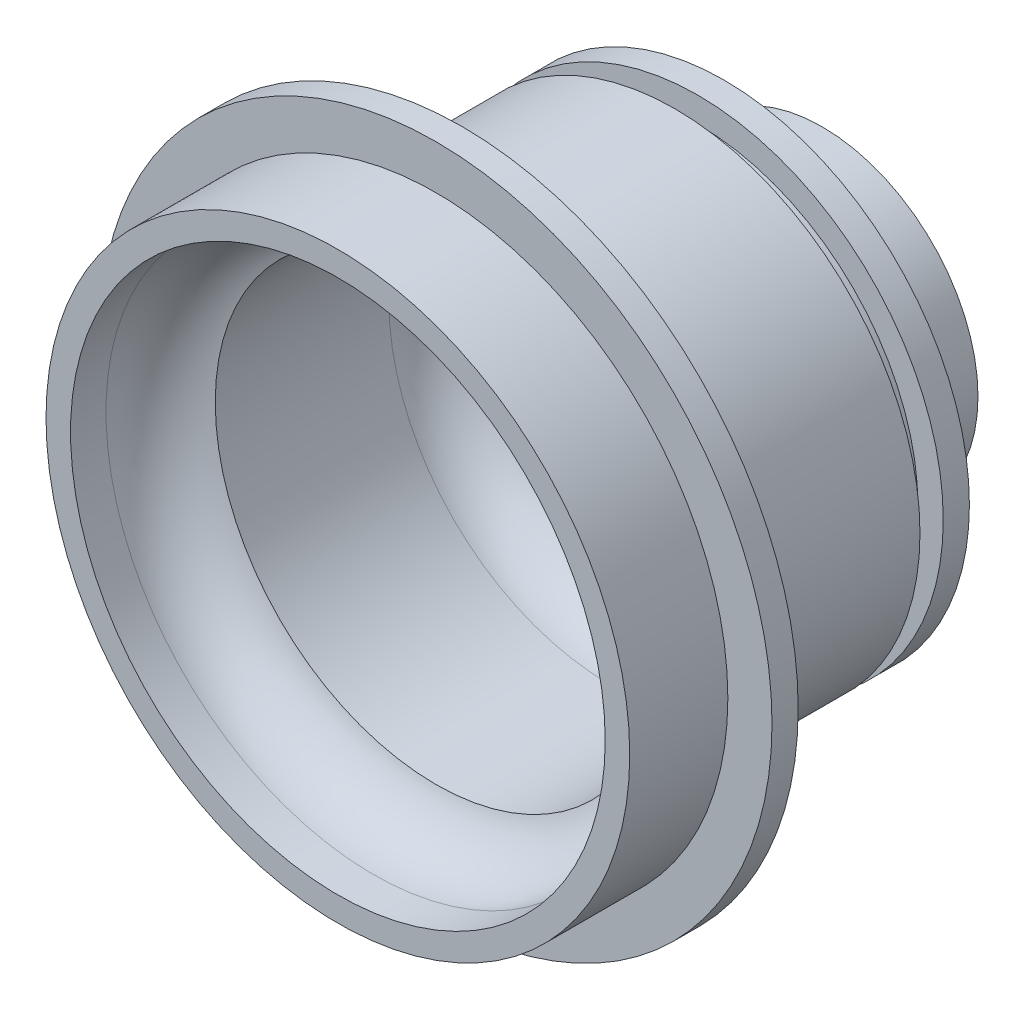
ISO-10303-21;
HEADER;
FILE_DESCRIPTION(('STEP AP214'),'2;1');
FILE_NAME('part.step','',(''),(''),'','','');
FILE_SCHEMA(('AUTOMOTIVE_DESIGN { 1 0 10303 214 1 1 1 1 }'));
ENDSEC;
DATA;
#1=APPLICATION_CONTEXT('core data for automotive mechanical design processes');
#2=APPLICATION_PROTOCOL_DEFINITION('international standard','automotive_design',2000,#1);
#3=PRODUCT_CONTEXT('',#1,'mechanical');
#4=PRODUCT('Part','Part','',(#3));
#5=PRODUCT_RELATED_PRODUCT_CATEGORY('part','',(#4));
#6=PRODUCT_DEFINITION_FORMATION('','',#4);
#7=PRODUCT_DEFINITION_CONTEXT('part definition',#1,'design');
#8=PRODUCT_DEFINITION('design','',#6,#7);
#9=PRODUCT_DEFINITION_SHAPE('','',#8);
#10=(LENGTH_UNIT() NAMED_UNIT(*) SI_UNIT(.MILLI.,.METRE.));
#11=(NAMED_UNIT(*) PLANE_ANGLE_UNIT() SI_UNIT($,.RADIAN.));
#12=(NAMED_UNIT(*) SI_UNIT($,.STERADIAN.) SOLID_ANGLE_UNIT());
#13=UNCERTAINTY_MEASURE_WITH_UNIT(LENGTH_MEASURE(1.E-05),#10,'distance_accuracy_value','');
#14=(GEOMETRIC_REPRESENTATION_CONTEXT(3) GLOBAL_UNCERTAINTY_ASSIGNED_CONTEXT((#13)) GLOBAL_UNIT_ASSIGNED_CONTEXT((#10,
#11,#12)) REPRESENTATION_CONTEXT('',''));
#15=CARTESIAN_POINT('',(0.,0.,0.));
#16=DIRECTION('',(0.,0.,1.));
#17=DIRECTION('',(1.,0.,0.));
#18=AXIS2_PLACEMENT_3D('',#15,#16,#17);
#19=CARTESIAN_POINT('',(0.,6.525,-15.5224));
#20=DIRECTION('',(0.,0.,1.));
#21=DIRECTION('',(1.,0.,0.));
#22=AXIS2_PLACEMENT_3D('',#19,#20,#21);
#23=PLANE('',#22);
#24=CARTESIAN_POINT('',(0.,0.,-15.5224));
#25=DIRECTION('',(0.,0.,1.));
#26=DIRECTION('',(1.,0.,0.));
#27=AXIS2_PLACEMENT_3D('',#24,#25,#26);
#28=CIRCLE('',#27,9.525);
#29=CARTESIAN_POINT('',(9.525,0.,-15.5224));
#30=VERTEX_POINT('',#29);
#31=EDGE_CURVE('E102',#30,#30,#28,.T.);
#32=ORIENTED_EDGE('',*,*,#31,.F.);
#33=EDGE_LOOP('',(#32));
#34=FACE_BOUND('',#33,.T.);
#35=CARTESIAN_POINT('',(0.,0.,-15.5224));
#36=DIRECTION('',(0.,0.,1.));
#37=DIRECTION('',(1.,0.,0.));
#38=AXIS2_PLACEMENT_3D('',#35,#36,#37);
#39=CIRCLE('',#38,6.525);
#40=CARTESIAN_POINT('',(6.525,0.,-15.5224));
#41=VERTEX_POINT('',#40);
#42=EDGE_CURVE('E45',#41,#41,#39,.T.);
#43=ORIENTED_EDGE('',*,*,#42,.T.);
#44=EDGE_LOOP('',(#43));
#45=FACE_BOUND('',#44,.T.);
#46=ADVANCED_FACE('F34',(#34,#45),#23,.F.);
#47=CARTESIAN_POINT('',(0.,0.,74.8043604531623));
#48=DIRECTION('',(0.,0.,1.));
#49=DIRECTION('',(1.,0.,0.));
#50=AXIS2_PLACEMENT_3D('',#47,#48,#49);
#51=CYLINDRICAL_SURFACE('',#50,6.525);
#52=ORIENTED_EDGE('',*,*,#42,.F.);
#53=EDGE_LOOP('',(#52));
#54=FACE_BOUND('',#53,.T.);
#55=CARTESIAN_POINT('',(0.,0.,-8.5224));
#56=DIRECTION('',(0.,0.,1.));
#57=DIRECTION('',(1.,0.,0.));
#58=AXIS2_PLACEMENT_3D('',#55,#56,#57);
#59=CIRCLE('',#58,6.525);
#60=CARTESIAN_POINT('',(6.525,0.,-8.5224));
#61=VERTEX_POINT('',#60);
#62=EDGE_CURVE('E49',#61,#61,#59,.T.);
#63=ORIENTED_EDGE('',*,*,#62,.T.);
#64=EDGE_LOOP('',(#63));
#65=FACE_BOUND('',#64,.T.);
#66=ADVANCED_FACE('F110',(#54,#65),#51,.F.);
#67=CARTESIAN_POINT('',(0.,0.,-8.5224));
#68=DIRECTION('',(0.,0.,1.));
#69=DIRECTION('',(1.,0.,0.));
#70=AXIS2_PLACEMENT_3D('',#67,#68,#69);
#71=TOROIDAL_SURFACE('',#70,8.525,2.);
#72=ORIENTED_EDGE('',*,*,#62,.F.);
#73=EDGE_LOOP('',(#72));
#74=FACE_BOUND('',#73,.T.);
#75=CARTESIAN_POINT('',(0.,0.,-6.5224));
#76=DIRECTION('',(0.,0.,1.));
#77=DIRECTION('',(1.,0.,0.));
#78=AXIS2_PLACEMENT_3D('',#75,#76,#77);
#79=CIRCLE('',#78,8.525);
#80=CARTESIAN_POINT('',(8.525,0.,-6.5224));
#81=VERTEX_POINT('',#80);
#82=EDGE_CURVE('E54',#81,#81,#79,.T.);
#83=ORIENTED_EDGE('',*,*,#82,.T.);
#84=EDGE_LOOP('',(#83));
#85=FACE_BOUND('',#84,.T.);
#86=ADVANCED_FACE('F115',(#74,#85),#71,.T.);
#87=CARTESIAN_POINT('',(0.,9.5,-6.5224));
#88=DIRECTION('',(0.,0.,-1.));
#89=DIRECTION('',(-1.,0.,0.));
#90=AXIS2_PLACEMENT_3D('',#87,#88,#89);
#91=PLANE('',#90);
#92=ORIENTED_EDGE('',*,*,#82,.F.);
#93=EDGE_LOOP('',(#92));
#94=FACE_BOUND('',#93,.T.);
#95=CARTESIAN_POINT('',(0.,0.,-6.5224));
#96=DIRECTION('',(0.,0.,1.));
#97=DIRECTION('',(1.,0.,0.));
#98=AXIS2_PLACEMENT_3D('',#95,#96,#97);
#99=CIRCLE('',#98,9.5);
#100=CARTESIAN_POINT('',(9.5,0.,-6.5224));
#101=VERTEX_POINT('',#100);
#102=EDGE_CURVE('E57',#101,#101,#99,.T.);
#103=ORIENTED_EDGE('',*,*,#102,.T.);
#104=EDGE_LOOP('',(#103));
#105=FACE_BOUND('',#104,.T.);
#106=ADVANCED_FACE('F121',(#94,#105),#91,.F.);
#107=CARTESIAN_POINT('',(0.,0.,-2.5224));
#108=DIRECTION('',(0.,0.,1.));
#109=DIRECTION('',(1.,0.,0.));
#110=AXIS2_PLACEMENT_3D('',#107,#108,#109);
#111=TOROIDAL_SURFACE('',#110,9.5,4.);
#112=ORIENTED_EDGE('',*,*,#102,.F.);
#113=EDGE_LOOP('',(#112));
#114=FACE_BOUND('',#113,.T.);
#115=CARTESIAN_POINT('',(0.,0.,-2.52239999999999));
#116=DIRECTION('',(0.,0.,1.));
#117=DIRECTION('',(1.,0.,0.));
#118=AXIS2_PLACEMENT_3D('',#115,#116,#117);
#119=CIRCLE('',#118,13.5);
#120=CARTESIAN_POINT('',(13.5,0.,-2.52239999999999));
#121=VERTEX_POINT('',#120);
#122=EDGE_CURVE('E60',#121,#121,#119,.T.);
#123=ORIENTED_EDGE('',*,*,#122,.T.);
#124=EDGE_LOOP('',(#123));
#125=FACE_BOUND('',#124,.T.);
#126=ADVANCED_FACE('F127',(#114,#125),#111,.F.);
#127=CARTESIAN_POINT('',(0.,0.,74.8043604531623));
#128=DIRECTION('',(0.,0.,1.));
#129=DIRECTION('',(1.,0.,0.));
#130=AXIS2_PLACEMENT_3D('',#127,#128,#129);
#131=CYLINDRICAL_SURFACE('',#130,13.5);
#132=ORIENTED_EDGE('',*,*,#122,.F.);
#133=EDGE_LOOP('',(#132));
#134=FACE_BOUND('',#133,.T.);
#135=CARTESIAN_POINT('',(0.,0.,8.1));
#136=DIRECTION('',(0.,0.,1.));
#137=DIRECTION('',(1.,0.,0.));
#138=AXIS2_PLACEMENT_3D('',#135,#136,#137);
#139=CIRCLE('',#138,13.5);
#140=CARTESIAN_POINT('',(13.5,0.,8.1));
#141=VERTEX_POINT('',#140);
#142=EDGE_CURVE('E63',#141,#141,#139,.T.);
#143=ORIENTED_EDGE('',*,*,#142,.T.);
#144=EDGE_LOOP('',(#143));
#145=FACE_BOUND('',#144,.T.);
#146=ADVANCED_FACE('F133',(#134,#145),#131,.F.);
#147=CARTESIAN_POINT('',(0.,0.,11.9311225508981));
#148=DIRECTION('',(0.,0.,1.));
#149=DIRECTION('',(1.,0.,0.));
#150=AXIS2_PLACEMENT_3D('',#147,#148,#149);
#151=TOROIDAL_SURFACE('',#150,12.35,4.);
#152=ORIENTED_EDGE('',*,*,#142,.F.);
#153=EDGE_LOOP('',(#152));
#154=FACE_BOUND('',#153,.T.);
#155=CARTESIAN_POINT('',(0.,0.,11.9311225508981));
#156=DIRECTION('',(0.,0.,1.));
#157=DIRECTION('',(1.,0.,0.));
#158=AXIS2_PLACEMENT_3D('',#155,#156,#157);
#159=CIRCLE('',#158,16.35);
#160=CARTESIAN_POINT('',(16.35,0.,11.9311225508981));
#161=VERTEX_POINT('',#160);
#162=EDGE_CURVE('E66',#161,#161,#159,.T.);
#163=ORIENTED_EDGE('',*,*,#162,.T.);
#164=EDGE_LOOP('',(#163));
#165=FACE_BOUND('',#164,.T.);
#166=ADVANCED_FACE('F139',(#154,#165),#151,.F.);
#167=CARTESIAN_POINT('',(0.,0.,74.8043604531623));
#168=DIRECTION('',(0.,0.,1.));
#169=DIRECTION('',(1.,0.,0.));
#170=AXIS2_PLACEMENT_3D('',#167,#168,#169);
#171=CYLINDRICAL_SURFACE('',#170,16.35);
#172=ORIENTED_EDGE('',*,*,#162,.F.);
#173=EDGE_LOOP('',(#172));
#174=FACE_BOUND('',#173,.T.);
#175=CARTESIAN_POINT('',(0.,0.,14.1));
#176=DIRECTION('',(0.,0.,1.));
#177=DIRECTION('',(1.,0.,0.));
#178=AXIS2_PLACEMENT_3D('',#175,#176,#177);
#179=CIRCLE('',#178,16.35);
#180=CARTESIAN_POINT('',(16.35,0.,14.1));
#181=VERTEX_POINT('',#180);
#182=EDGE_CURVE('E69',#181,#181,#179,.T.);
#183=ORIENTED_EDGE('',*,*,#182,.T.);
#184=EDGE_LOOP('',(#183));
#185=FACE_BOUND('',#184,.T.);
#186=ADVANCED_FACE('F145',(#174,#185),#171,.F.);
#187=CARTESIAN_POINT('',(0.,17.85,14.1));
#188=DIRECTION('',(0.,0.,-1.));
#189=DIRECTION('',(-1.,0.,0.));
#190=AXIS2_PLACEMENT_3D('',#187,#188,#189);
#191=PLANE('',#190);
#192=ORIENTED_EDGE('',*,*,#182,.F.);
#193=EDGE_LOOP('',(#192));
#194=FACE_BOUND('',#193,.T.);
#195=CARTESIAN_POINT('',(0.,0.,14.1));
#196=DIRECTION('',(0.,0.,1.));
#197=DIRECTION('',(1.,0.,0.));
#198=AXIS2_PLACEMENT_3D('',#195,#196,#197);
#199=CIRCLE('',#198,17.85);
#200=CARTESIAN_POINT('',(17.85,0.,14.1));
#201=VERTEX_POINT('',#200);
#202=EDGE_CURVE('E72',#201,#201,#199,.T.);
#203=ORIENTED_EDGE('',*,*,#202,.T.);
#204=EDGE_LOOP('',(#203));
#205=FACE_BOUND('',#204,.T.);
#206=ADVANCED_FACE('F151',(#194,#205),#191,.F.);
#207=CARTESIAN_POINT('',(0.,0.,74.8043604531623));
#208=DIRECTION('',(0.,0.,1.));
#209=DIRECTION('',(1.,0.,0.));
#210=AXIS2_PLACEMENT_3D('',#207,#208,#209);
#211=CYLINDRICAL_SURFACE('',#210,17.85);
#212=ORIENTED_EDGE('',*,*,#202,.F.);
#213=EDGE_LOOP('',(#212));
#214=FACE_BOUND('',#213,.T.);
#215=CARTESIAN_POINT('',(0.,0.,8.1));
#216=DIRECTION('',(0.,0.,1.));
#217=DIRECTION('',(1.,0.,0.));
#218=AXIS2_PLACEMENT_3D('',#215,#216,#217);
#219=CIRCLE('',#218,17.85);
#220=CARTESIAN_POINT('',(17.85,0.,8.1));
#221=VERTEX_POINT('',#220);
#222=EDGE_CURVE('E75',#221,#221,#219,.T.);
#223=ORIENTED_EDGE('',*,*,#222,.T.);
#224=EDGE_LOOP('',(#223));
#225=FACE_BOUND('',#224,.T.);
#226=ADVANCED_FACE('F157',(#214,#225),#211,.T.);
#227=CARTESIAN_POINT('',(0.,20.55,8.1));
#228=DIRECTION('',(0.,0.,-1.));
#229=DIRECTION('',(-1.,0.,0.));
#230=AXIS2_PLACEMENT_3D('',#227,#228,#229);
#231=PLANE('',#230);
#232=ORIENTED_EDGE('',*,*,#222,.F.);
#233=EDGE_LOOP('',(#232));
#234=FACE_BOUND('',#233,.T.);
#235=CARTESIAN_POINT('',(0.,0.,8.1));
#236=DIRECTION('',(0.,0.,1.));
#237=DIRECTION('',(1.,0.,0.));
#238=AXIS2_PLACEMENT_3D('',#235,#236,#237);
#239=CIRCLE('',#238,20.55);
#240=CARTESIAN_POINT('',(20.55,0.,8.1));
#241=VERTEX_POINT('',#240);
#242=EDGE_CURVE('E78',#241,#241,#239,.T.);
#243=ORIENTED_EDGE('',*,*,#242,.T.);
#244=EDGE_LOOP('',(#243));
#245=FACE_BOUND('',#244,.T.);
#246=ADVANCED_FACE('F163',(#234,#245),#231,.F.);
#247=CARTESIAN_POINT('',(0.,0.,74.8043604531623));
#248=DIRECTION('',(0.,0.,1.));
#249=DIRECTION('',(1.,0.,0.));
#250=AXIS2_PLACEMENT_3D('',#247,#248,#249);
#251=CYLINDRICAL_SURFACE('',#250,20.55);
#252=ORIENTED_EDGE('',*,*,#242,.F.);
#253=EDGE_LOOP('',(#252));
#254=FACE_BOUND('',#253,.T.);
#255=CARTESIAN_POINT('',(0.,0.,6.50000000000001));
#256=DIRECTION('',(0.,0.,1.));
#257=DIRECTION('',(1.,0.,0.));
#258=AXIS2_PLACEMENT_3D('',#255,#256,#257);
#259=CIRCLE('',#258,20.55);
#260=CARTESIAN_POINT('',(20.55,0.,6.50000000000001));
#261=VERTEX_POINT('',#260);
#262=EDGE_CURVE('E81',#261,#261,#259,.T.);
#263=ORIENTED_EDGE('',*,*,#262,.T.);
#264=EDGE_LOOP('',(#263));
#265=FACE_BOUND('',#264,.T.);
#266=ADVANCED_FACE('F169',(#254,#265),#251,.T.);
#267=CARTESIAN_POINT('',(0.,15.,6.5));
#268=DIRECTION('',(0.,0.,1.));
#269=DIRECTION('',(1.,0.,0.));
#270=AXIS2_PLACEMENT_3D('',#267,#268,#269);
#271=PLANE('',#270);
#272=ORIENTED_EDGE('',*,*,#262,.F.);
#273=EDGE_LOOP('',(#272));
#274=FACE_BOUND('',#273,.T.);
#275=CARTESIAN_POINT('',(0.,0.,6.50000000000001));
#276=DIRECTION('',(0.,0.,1.));
#277=DIRECTION('',(1.,0.,0.));
#278=AXIS2_PLACEMENT_3D('',#275,#276,#277);
#279=CIRCLE('',#278,15.);
#280=CARTESIAN_POINT('',(15.,0.,6.50000000000001));
#281=VERTEX_POINT('',#280);
#282=EDGE_CURVE('E84',#281,#281,#279,.T.);
#283=ORIENTED_EDGE('',*,*,#282,.T.);
#284=EDGE_LOOP('',(#283));
#285=FACE_BOUND('',#284,.T.);
#286=ADVANCED_FACE('F175',(#274,#285),#271,.F.);
#287=CARTESIAN_POINT('',(0.,0.,74.8043604531623));
#288=DIRECTION('',(0.,0.,1.));
#289=DIRECTION('',(1.,0.,0.));
#290=AXIS2_PLACEMENT_3D('',#287,#288,#289);
#291=CYLINDRICAL_SURFACE('',#290,15.);
#292=ORIENTED_EDGE('',*,*,#282,.F.);
#293=EDGE_LOOP('',(#292));
#294=FACE_BOUND('',#293,.T.);
#295=CARTESIAN_POINT('',(0.,0.,-6.50000000000001));
#296=DIRECTION('',(0.,0.,1.));
#297=DIRECTION('',(1.,0.,0.));
#298=AXIS2_PLACEMENT_3D('',#295,#296,#297);
#299=CIRCLE('',#298,15.);
#300=CARTESIAN_POINT('',(15.,0.,-6.50000000000001));
#301=VERTEX_POINT('',#300);
#302=EDGE_CURVE('E87',#301,#301,#299,.T.);
#303=ORIENTED_EDGE('',*,*,#302,.T.);
#304=EDGE_LOOP('',(#303));
#305=FACE_BOUND('',#304,.T.);
#306=ADVANCED_FACE('F181',(#294,#305),#291,.T.);
#307=CARTESIAN_POINT('',(0.,13.45,-6.5));
#308=DIRECTION('',(0.,0.,1.));
#309=DIRECTION('',(1.,0.,0.));
#310=AXIS2_PLACEMENT_3D('',#307,#308,#309);
#311=PLANE('',#310);
#312=ORIENTED_EDGE('',*,*,#302,.F.);
#313=EDGE_LOOP('',(#312));
#314=FACE_BOUND('',#313,.T.);
#315=CARTESIAN_POINT('',(0.,0.,-6.50000000000001));
#316=DIRECTION('',(0.,0.,1.));
#317=DIRECTION('',(1.,0.,0.));
#318=AXIS2_PLACEMENT_3D('',#315,#316,#317);
#319=CIRCLE('',#318,13.45);
#320=CARTESIAN_POINT('',(13.45,0.,-6.50000000000001));
#321=VERTEX_POINT('',#320);
#322=EDGE_CURVE('E90',#321,#321,#319,.T.);
#323=ORIENTED_EDGE('',*,*,#322,.T.);
#324=EDGE_LOOP('',(#323));
#325=FACE_BOUND('',#324,.T.);
#326=ADVANCED_FACE('F187',(#314,#325),#311,.F.);
#327=CARTESIAN_POINT('',(0.,0.,74.8043604531623));
#328=DIRECTION('',(0.,0.,1.));
#329=DIRECTION('',(1.,0.,0.));
#330=AXIS2_PLACEMENT_3D('',#327,#328,#329);
#331=CYLINDRICAL_SURFACE('',#330,13.45);
#332=ORIENTED_EDGE('',*,*,#322,.F.);
#333=EDGE_LOOP('',(#332));
#334=FACE_BOUND('',#333,.T.);
#335=CARTESIAN_POINT('',(0.,0.,-7.9224));
#336=DIRECTION('',(0.,0.,1.));
#337=DIRECTION('',(1.,0.,0.));
#338=AXIS2_PLACEMENT_3D('',#335,#336,#337);
#339=CIRCLE('',#338,13.45);
#340=CARTESIAN_POINT('',(13.45,0.,-7.9224));
#341=VERTEX_POINT('',#340);
#342=EDGE_CURVE('E93',#341,#341,#339,.T.);
#343=ORIENTED_EDGE('',*,*,#342,.T.);
#344=EDGE_LOOP('',(#343));
#345=FACE_BOUND('',#344,.T.);
#346=ADVANCED_FACE('F193',(#334,#345),#331,.T.);
#347=CARTESIAN_POINT('',(0.,15.,-7.9224));
#348=DIRECTION('',(0.,0.,-1.));
#349=DIRECTION('',(-1.,0.,0.));
#350=AXIS2_PLACEMENT_3D('',#347,#348,#349);
#351=PLANE('',#350);
#352=ORIENTED_EDGE('',*,*,#342,.F.);
#353=EDGE_LOOP('',(#352));
#354=FACE_BOUND('',#353,.T.);
#355=CARTESIAN_POINT('',(0.,0.,-7.9224));
#356=DIRECTION('',(0.,0.,1.));
#357=DIRECTION('',(1.,0.,0.));
#358=AXIS2_PLACEMENT_3D('',#355,#356,#357);
#359=CIRCLE('',#358,15.);
#360=CARTESIAN_POINT('',(15.,0.,-7.9224));
#361=VERTEX_POINT('',#360);
#362=EDGE_CURVE('E96',#361,#361,#359,.T.);
#363=ORIENTED_EDGE('',*,*,#362,.T.);
#364=EDGE_LOOP('',(#363));
#365=FACE_BOUND('',#364,.T.);
#366=ADVANCED_FACE('F199',(#354,#365),#351,.F.);
#367=CARTESIAN_POINT('',(0.,0.,74.8043604531623));
#368=DIRECTION('',(0.,0.,1.));
#369=DIRECTION('',(1.,0.,0.));
#370=AXIS2_PLACEMENT_3D('',#367,#368,#369);
#371=CYLINDRICAL_SURFACE('',#370,15.);
#372=ORIENTED_EDGE('',*,*,#362,.F.);
#373=EDGE_LOOP('',(#372));
#374=FACE_BOUND('',#373,.T.);
#375=CARTESIAN_POINT('',(0.,0.,-9.5224));
#376=DIRECTION('',(0.,0.,1.));
#377=DIRECTION('',(1.,0.,0.));
#378=AXIS2_PLACEMENT_3D('',#375,#376,#377);
#379=CIRCLE('',#378,15.);
#380=CARTESIAN_POINT('',(15.,0.,-9.5224));
#381=VERTEX_POINT('',#380);
#382=EDGE_CURVE('E99',#381,#381,#379,.T.);
#383=ORIENTED_EDGE('',*,*,#382,.T.);
#384=EDGE_LOOP('',(#383));
#385=FACE_BOUND('',#384,.T.);
#386=ADVANCED_FACE('F205',(#374,#385),#371,.T.);
#387=CARTESIAN_POINT('',(0.,9.525,-9.5224));
#388=DIRECTION('',(0.,0.,1.));
#389=DIRECTION('',(1.,0.,0.));
#390=AXIS2_PLACEMENT_3D('',#387,#388,#389);
#391=PLANE('',#390);
#392=CARTESIAN_POINT('',(0.,0.,-9.5224));
#393=DIRECTION('',(0.,0.,1.));
#394=DIRECTION('',(1.,0.,0.));
#395=AXIS2_PLACEMENT_3D('',#392,#393,#394);
#396=CIRCLE('',#395,11.525);
#397=CARTESIAN_POINT('',(11.525,0.,-9.5224));
#398=VERTEX_POINT('',#397);
#399=EDGE_CURVE('E41',#398,#398,#396,.T.);
#400=ORIENTED_EDGE('',*,*,#399,.T.);
#401=EDGE_LOOP('',(#400));
#402=FACE_BOUND('',#401,.T.);
#403=ORIENTED_EDGE('',*,*,#382,.F.);
#404=EDGE_LOOP('',(#403));
#405=FACE_BOUND('',#404,.T.);
#406=ADVANCED_FACE('F211',(#402,#405),#391,.F.);
#407=CARTESIAN_POINT('',(0.,0.,74.8043604531623));
#408=DIRECTION('',(0.,0.,1.));
#409=DIRECTION('',(1.,0.,0.));
#410=AXIS2_PLACEMENT_3D('',#407,#408,#409);
#411=CYLINDRICAL_SURFACE('',#410,9.525);
#412=CARTESIAN_POINT('',(0.,0.,-11.5224));
#413=DIRECTION('',(0.,0.,1.));
#414=DIRECTION('',(1.,0.,0.));
#415=AXIS2_PLACEMENT_3D('',#412,#413,#414);
#416=CIRCLE('',#415,9.525);
#417=CARTESIAN_POINT('',(9.525,0.,-11.5224));
#418=VERTEX_POINT('',#417);
#419=EDGE_CURVE('E10',#418,#418,#416,.F.);
#420=ORIENTED_EDGE('',*,*,#419,.T.);
#421=EDGE_LOOP('',(#420));
#422=FACE_BOUND('',#421,.T.);
#423=ORIENTED_EDGE('',*,*,#31,.T.);
#424=EDGE_LOOP('',(#423));
#425=FACE_BOUND('',#424,.T.);
#426=ADVANCED_FACE('F106',(#422,#425),#411,.T.);
#427=CARTESIAN_POINT('',(0.,0.,-11.5224));
#428=DIRECTION('',(0.,0.,1.));
#429=DIRECTION('',(1.,0.,0.));
#430=AXIS2_PLACEMENT_3D('',#427,#428,#429);
#431=TOROIDAL_SURFACE('',#430,11.525,2.);
#432=ORIENTED_EDGE('',*,*,#419,.F.);
#433=EDGE_LOOP('',(#432));
#434=FACE_BOUND('',#433,.T.);
#435=ORIENTED_EDGE('',*,*,#399,.F.);
#436=EDGE_LOOP('',(#435));
#437=FACE_BOUND('',#436,.T.);
#438=ADVANCED_FACE('F36',(#434,#437),#431,.F.);
#439=CLOSED_SHELL('',(#46,#66,#86,#106,#126,#146,#166,#186,#206,#226,#246,#266,#286,#306,#326,
#346,#366,#386,#406,#426,#438));
#440=MANIFOLD_SOLID_BREP('B2',#439);
#441=ADVANCED_BREP_SHAPE_REPRESENTATION('',(#18,#440),#14);
#442=SHAPE_DEFINITION_REPRESENTATION(#9,#441);
ENDSEC;
END-ISO-10303-21;
